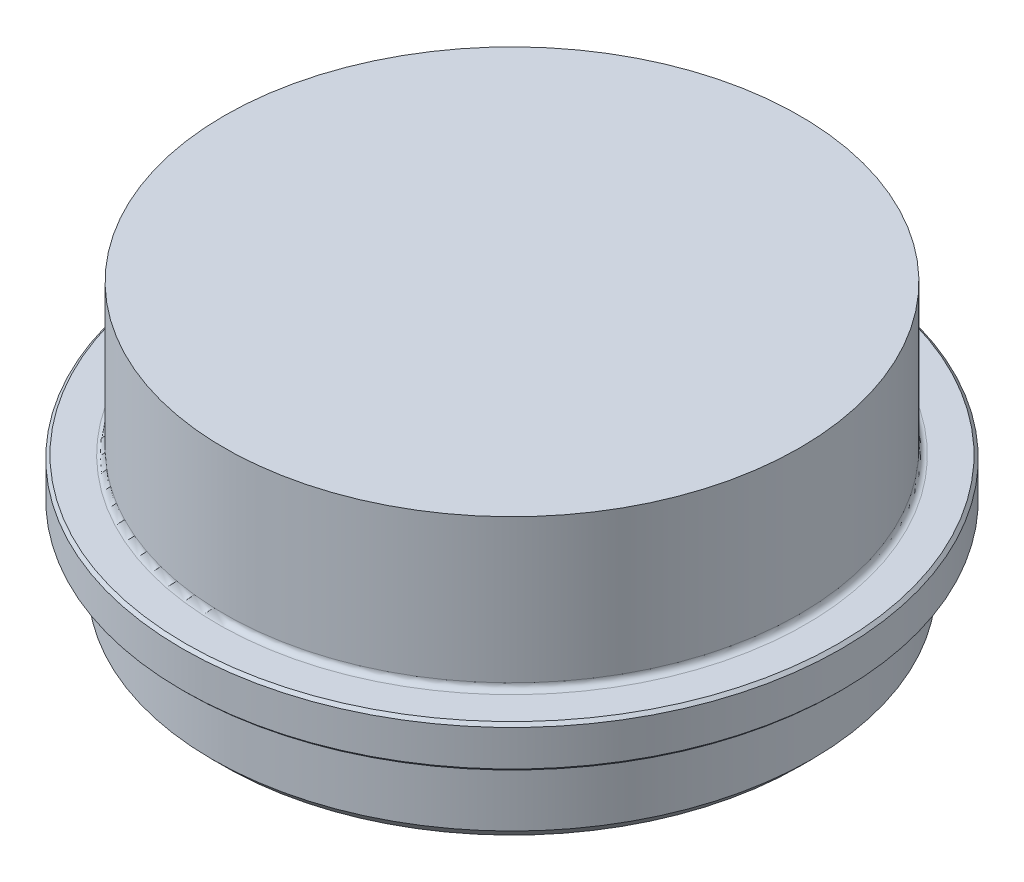
ISO-10303-21;
HEADER;
FILE_DESCRIPTION(('STEP AP214'),'2;1');
FILE_NAME('part.step','',(''),(''),'','','');
FILE_SCHEMA(('AUTOMOTIVE_DESIGN { 1 0 10303 214 1 1 1 1 }'));
ENDSEC;
DATA;
#1=APPLICATION_CONTEXT('core data for automotive mechanical design processes');
#2=APPLICATION_PROTOCOL_DEFINITION('international standard','automotive_design',2000,#1);
#3=PRODUCT_CONTEXT('',#1,'mechanical');
#4=PRODUCT('Part','Part','',(#3));
#5=PRODUCT_RELATED_PRODUCT_CATEGORY('part','',(#4));
#6=PRODUCT_DEFINITION_FORMATION('','',#4);
#7=PRODUCT_DEFINITION_CONTEXT('part definition',#1,'design');
#8=PRODUCT_DEFINITION('design','',#6,#7);
#9=PRODUCT_DEFINITION_SHAPE('','',#8);
#10=(LENGTH_UNIT() NAMED_UNIT(*) SI_UNIT(.MILLI.,.METRE.));
#11=(NAMED_UNIT(*) PLANE_ANGLE_UNIT() SI_UNIT($,.RADIAN.));
#12=(NAMED_UNIT(*) SI_UNIT($,.STERADIAN.) SOLID_ANGLE_UNIT());
#13=UNCERTAINTY_MEASURE_WITH_UNIT(LENGTH_MEASURE(1.E-05),#10,'distance_accuracy_value','');
#14=(GEOMETRIC_REPRESENTATION_CONTEXT(3) GLOBAL_UNCERTAINTY_ASSIGNED_CONTEXT((#13)) GLOBAL_UNIT_ASSIGNED_CONTEXT((#10,
#11,#12)) REPRESENTATION_CONTEXT('',''));
#15=CARTESIAN_POINT('',(0.,0.,0.));
#16=DIRECTION('',(0.,0.,1.));
#17=DIRECTION('',(1.,0.,0.));
#18=AXIS2_PLACEMENT_3D('',#15,#16,#17);
#19=CARTESIAN_POINT('',(27.5,-16.,0.));
#20=DIRECTION('',(0.,-1.,0.));
#21=DIRECTION('',(1.,0.,0.));
#22=AXIS2_PLACEMENT_3D('',#19,#20,#21);
#23=PLANE('',#22);
#24=CARTESIAN_POINT('',(0.,-16.0000000000001,0.));
#25=DIRECTION('',(0.,-1.,0.));
#26=DIRECTION('',(1.,0.,0.));
#27=AXIS2_PLACEMENT_3D('',#24,#25,#26);
#28=CIRCLE('',#27,27.2500000000001);
#29=CARTESIAN_POINT('',(27.2500000000001,-16.,0.));
#30=VERTEX_POINT('',#29);
#31=EDGE_CURVE('E67',#30,#30,#28,.T.);
#32=ORIENTED_EDGE('',*,*,#31,.T.);
#33=EDGE_LOOP('',(#32));
#34=FACE_BOUND('',#33,.T.);
#35=CARTESIAN_POINT('',(0.,-16.0000000000001,0.));
#36=DIRECTION('',(0.,-1.,0.));
#37=DIRECTION('',(1.,0.,0.));
#38=AXIS2_PLACEMENT_3D('',#35,#36,#37);
#39=CIRCLE('',#38,24.9999999999999);
#40=CARTESIAN_POINT('',(25.,-16.,0.));
#41=VERTEX_POINT('',#40);
#42=EDGE_CURVE('E94',#41,#41,#39,.T.);
#43=ORIENTED_EDGE('',*,*,#42,.F.);
#44=EDGE_LOOP('',(#43));
#45=FACE_BOUND('',#44,.T.);
#46=ADVANCED_FACE('F38',(#34,#45),#23,.T.);
#47=CARTESIAN_POINT('',(1.35268772757415E-12,-394.34097291874,0.));
#48=DIRECTION('',(0.,-1.,0.));
#49=DIRECTION('',(1.,0.,0.));
#50=AXIS2_PLACEMENT_3D('',#47,#48,#49);
#51=CYLINDRICAL_SURFACE('',#50,27.5);
#52=CARTESIAN_POINT('',(0.,-15.7500000000002,0.));
#53=DIRECTION('',(0.,-1.,0.));
#54=DIRECTION('',(1.,0.,0.));
#55=AXIS2_PLACEMENT_3D('',#52,#53,#54);
#56=CIRCLE('',#55,27.5);
#57=CARTESIAN_POINT('',(27.5,-15.7500000000001,0.));
#58=VERTEX_POINT('',#57);
#59=EDGE_CURVE('E61',#58,#58,#56,.F.);
#60=ORIENTED_EDGE('',*,*,#59,.T.);
#61=EDGE_LOOP('',(#60));
#62=FACE_BOUND('',#61,.T.);
#63=CARTESIAN_POINT('',(0.,-12.7500000000001,0.));
#64=DIRECTION('',(0.,1.,0.));
#65=DIRECTION('',(-1.,0.,0.));
#66=AXIS2_PLACEMENT_3D('',#63,#64,#65);
#67=CIRCLE('',#66,27.5);
#68=CARTESIAN_POINT('',(-27.4999999999999,-12.7500000000002,0.));
#69=VERTEX_POINT('',#68);
#70=EDGE_CURVE('E64',#69,#69,#67,.F.);
#71=ORIENTED_EDGE('',*,*,#70,.T.);
#72=EDGE_LOOP('',(#71));
#73=FACE_BOUND('',#72,.T.);
#74=ADVANCED_FACE('F170',(#62,#73),#51,.T.);
#75=CARTESIAN_POINT('',(27.5,-12.5,0.));
#76=DIRECTION('',(0.,1.,0.));
#77=DIRECTION('',(-1.,0.,0.));
#78=AXIS2_PLACEMENT_3D('',#75,#76,#77);
#79=PLANE('',#78);
#80=CARTESIAN_POINT('',(0.,-12.5000000000001,0.));
#81=DIRECTION('',(0.,1.,0.));
#82=DIRECTION('',(-1.,0.,0.));
#83=AXIS2_PLACEMENT_3D('',#80,#81,#82);
#84=CIRCLE('',#83,24.5);
#85=CARTESIAN_POINT('',(-24.4999999999999,-12.5000000000002,0.));
#86=VERTEX_POINT('',#85);
#87=EDGE_CURVE('E53',#86,#86,#84,.F.);
#88=ORIENTED_EDGE('',*,*,#87,.T.);
#89=EDGE_LOOP('',(#88));
#90=FACE_BOUND('',#89,.T.);
#91=CARTESIAN_POINT('',(0.,-12.5000000000001,0.));
#92=DIRECTION('',(0.,1.,0.));
#93=DIRECTION('',(-1.,0.,0.));
#94=AXIS2_PLACEMENT_3D('',#91,#92,#93);
#95=CIRCLE('',#94,27.2499999999999);
#96=CARTESIAN_POINT('',(-27.2499999999998,-12.5000000000002,0.));
#97=VERTEX_POINT('',#96);
#98=EDGE_CURVE('E58',#97,#97,#95,.T.);
#99=ORIENTED_EDGE('',*,*,#98,.T.);
#100=EDGE_LOOP('',(#99));
#101=FACE_BOUND('',#100,.T.);
#102=ADVANCED_FACE('F176',(#90,#101),#79,.T.);
#103=CARTESIAN_POINT('',(1.35268772757415E-12,-394.34097291874,0.));
#104=DIRECTION('',(0.,-1.,0.));
#105=DIRECTION('',(1.,0.,0.));
#106=AXIS2_PLACEMENT_3D('',#103,#104,#105);
#107=CYLINDRICAL_SURFACE('',#106,24.);
#108=CARTESIAN_POINT('',(0.,-12.0000000000001,0.));
#109=DIRECTION('',(0.,1.,0.));
#110=DIRECTION('',(-1.,0.,0.));
#111=AXIS2_PLACEMENT_3D('',#108,#109,#110);
#112=CIRCLE('',#111,24.);
#113=CARTESIAN_POINT('',(-23.9999999999999,-12.0000000000002,0.));
#114=VERTEX_POINT('',#113);
#115=EDGE_CURVE('E49',#114,#114,#112,.T.);
#116=ORIENTED_EDGE('',*,*,#115,.T.);
#117=EDGE_LOOP('',(#116));
#118=FACE_BOUND('',#117,.T.);
#119=CARTESIAN_POINT('',(0.,0.,0.));
#120=DIRECTION('',(0.,-1.,0.));
#121=DIRECTION('',(1.,0.,0.));
#122=AXIS2_PLACEMENT_3D('',#119,#120,#121);
#123=CIRCLE('',#122,24.);
#124=CARTESIAN_POINT('',(24.,0.,0.));
#125=VERTEX_POINT('',#124);
#126=EDGE_CURVE('E88',#125,#125,#123,.T.);
#127=ORIENTED_EDGE('',*,*,#126,.T.);
#128=EDGE_LOOP('',(#127));
#129=FACE_BOUND('',#128,.T.);
#130=ADVANCED_FACE('F214',(#118,#129),#107,.T.);
#131=CARTESIAN_POINT('',(0.,0.,0.));
#132=DIRECTION('',(0.,1.,0.));
#133=DIRECTION('',(-1.,0.,0.));
#134=AXIS2_PLACEMENT_3D('',#131,#132,#133);
#135=PLANE('',#134);
#136=ORIENTED_EDGE('',*,*,#126,.F.);
#137=EDGE_LOOP('',(#136));
#138=FACE_BOUND('',#137,.T.);
#139=ADVANCED_FACE('F222',(#138),#135,.T.);
#140=CARTESIAN_POINT('',(11.5,-4.99999999999998,0.));
#141=DIRECTION('',(0.,-1.,0.));
#142=DIRECTION('',(1.,0.,0.));
#143=AXIS2_PLACEMENT_3D('',#140,#141,#142);
#144=PLANE('',#143);
#145=CARTESIAN_POINT('',(0.,-5.00000000000002,0.));
#146=DIRECTION('',(0.,-1.,0.));
#147=DIRECTION('',(1.,0.,0.));
#148=AXIS2_PLACEMENT_3D('',#145,#146,#147);
#149=CIRCLE('',#148,11.);
#150=CARTESIAN_POINT('',(11.,-4.99999999999998,0.));
#151=VERTEX_POINT('',#150);
#152=EDGE_CURVE('E45',#151,#151,#149,.T.);
#153=ORIENTED_EDGE('',*,*,#152,.T.);
#154=EDGE_LOOP('',(#153));
#155=FACE_BOUND('',#154,.T.);
#156=ADVANCED_FACE('F228',(#155),#144,.T.);
#157=CARTESIAN_POINT('',(1.35268772757415E-12,-394.34097291874,0.));
#158=DIRECTION('',(0.,-1.,0.));
#159=DIRECTION('',(1.,0.,0.));
#160=AXIS2_PLACEMENT_3D('',#157,#158,#159);
#161=CYLINDRICAL_SURFACE('',#160,11.5);
#162=CARTESIAN_POINT('',(0.,-5.50000000000006,0.));
#163=DIRECTION('',(0.,-1.,0.));
#164=DIRECTION('',(1.,0.,0.));
#165=AXIS2_PLACEMENT_3D('',#162,#163,#164);
#166=CIRCLE('',#165,11.5);
#167=CARTESIAN_POINT('',(11.5,-5.50000000000002,0.));
#168=VERTEX_POINT('',#167);
#169=EDGE_CURVE('E10',#168,#168,#166,.F.);
#170=ORIENTED_EDGE('',*,*,#169,.T.);
#171=EDGE_LOOP('',(#170));
#172=FACE_BOUND('',#171,.T.);
#173=CARTESIAN_POINT('',(0.,-15.7500000000001,0.));
#174=DIRECTION('',(0.,-1.,0.));
#175=DIRECTION('',(1.,0.,0.));
#176=AXIS2_PLACEMENT_3D('',#173,#174,#175);
#177=CIRCLE('',#176,11.5);
#178=CARTESIAN_POINT('',(11.5,-15.7500000000001,0.));
#179=VERTEX_POINT('',#178);
#180=EDGE_CURVE('E73',#179,#179,#177,.T.);
#181=ORIENTED_EDGE('',*,*,#180,.T.);
#182=EDGE_LOOP('',(#181));
#183=FACE_BOUND('',#182,.T.);
#184=ADVANCED_FACE('F232',(#172,#183),#161,.F.);
#185=CARTESIAN_POINT('',(12.4,-16.,0.));
#186=DIRECTION('',(0.,-1.,0.));
#187=DIRECTION('',(1.,0.,0.));
#188=AXIS2_PLACEMENT_3D('',#185,#186,#187);
#189=PLANE('',#188);
#190=CARTESIAN_POINT('',(0.,-16.,0.));
#191=DIRECTION('',(0.,-1.,0.));
#192=DIRECTION('',(1.,0.,0.));
#193=AXIS2_PLACEMENT_3D('',#190,#191,#192);
#194=CIRCLE('',#193,11.7499999999999);
#195=CARTESIAN_POINT('',(11.7499999999999,-16.,0.));
#196=VERTEX_POINT('',#195);
#197=EDGE_CURVE('E70',#196,#196,#194,.F.);
#198=ORIENTED_EDGE('',*,*,#197,.T.);
#199=EDGE_LOOP('',(#198));
#200=FACE_BOUND('',#199,.T.);
#201=CARTESIAN_POINT('',(0.,-16.0000000000001,0.));
#202=DIRECTION('',(0.,-1.,0.));
#203=DIRECTION('',(1.,0.,0.));
#204=AXIS2_PLACEMENT_3D('',#201,#202,#203);
#205=CIRCLE('',#204,12.3999999999999);
#206=CARTESIAN_POINT('',(12.4,-16.,0.));
#207=VERTEX_POINT('',#206);
#208=EDGE_CURVE('E91',#207,#207,#205,.T.);
#209=ORIENTED_EDGE('',*,*,#208,.T.);
#210=EDGE_LOOP('',(#209));
#211=FACE_BOUND('',#210,.T.);
#212=ADVANCED_FACE('F235',(#200,#211),#189,.T.);
#213=CARTESIAN_POINT('',(1.35268772757415E-12,-394.34097291874,0.));
#214=DIRECTION('',(0.,-1.,0.));
#215=DIRECTION('',(1.,0.,0.));
#216=AXIS2_PLACEMENT_3D('',#213,#214,#215);
#217=CYLINDRICAL_SURFACE('',#216,12.3999999999999);
#218=CARTESIAN_POINT('',(0.,-22.0000000000001,0.));
#219=DIRECTION('',(0.,-1.,0.));
#220=DIRECTION('',(1.,0.,0.));
#221=AXIS2_PLACEMENT_3D('',#218,#219,#220);
#222=CIRCLE('',#221,12.3999999999999);
#223=CARTESIAN_POINT('',(12.4,-22.0000000000001,0.));
#224=VERTEX_POINT('',#223);
#225=EDGE_CURVE('E85',#224,#224,#222,.T.);
#226=ORIENTED_EDGE('',*,*,#225,.T.);
#227=EDGE_LOOP('',(#226));
#228=FACE_BOUND('',#227,.T.);
#229=ORIENTED_EDGE('',*,*,#208,.F.);
#230=EDGE_LOOP('',(#229));
#231=FACE_BOUND('',#230,.T.);
#232=ADVANCED_FACE('F141',(#228,#231),#217,.F.);
#233=CARTESIAN_POINT('',(25.,-23.,0.));
#234=DIRECTION('',(0.,-1.,0.));
#235=DIRECTION('',(1.,0.,0.));
#236=AXIS2_PLACEMENT_3D('',#233,#234,#235);
#237=PLANE('',#236);
#238=CARTESIAN_POINT('',(-14.1421356237309,-23.0000000000001,14.142135623731));
#239=DIRECTION('',(0.,-1.,0.));
#240=DIRECTION('',(-1.,0.,0.));
#241=AXIS2_PLACEMENT_3D('',#238,#239,#240);
#242=CIRCLE('',#241,2.5);
#243=CARTESIAN_POINT('',(-16.6421356237309,-23.0000000000001,14.142135623731));
#244=VERTEX_POINT('',#243);
#245=EDGE_CURVE('E111',#244,#244,#242,.T.);
#246=ORIENTED_EDGE('',*,*,#245,.F.);
#247=EDGE_LOOP('',(#246));
#248=FACE_BOUND('',#247,.T.);
#249=CARTESIAN_POINT('',(14.142135623731,-23.,-14.1421356237309));
#250=DIRECTION('',(0.,-1.,0.));
#251=DIRECTION('',(-1.,0.,0.));
#252=AXIS2_PLACEMENT_3D('',#249,#250,#251);
#253=CIRCLE('',#252,2.5);
#254=CARTESIAN_POINT('',(11.642135623731,-23.,-14.1421356237309));
#255=VERTEX_POINT('',#254);
#256=EDGE_CURVE('E104',#255,#255,#253,.T.);
#257=ORIENTED_EDGE('',*,*,#256,.F.);
#258=EDGE_LOOP('',(#257));
#259=FACE_BOUND('',#258,.T.);
#260=CARTESIAN_POINT('',(-14.1421356237309,-23.0000000000001,-14.1421356237309));
#261=DIRECTION('',(0.,-1.,0.));
#262=DIRECTION('',(1.,0.,0.));
#263=AXIS2_PLACEMENT_3D('',#260,#261,#262);
#264=CIRCLE('',#263,2.5);
#265=CARTESIAN_POINT('',(-11.6421356237309,-23.0000000000001,-14.1421356237309));
#266=VERTEX_POINT('',#265);
#267=EDGE_CURVE('E122',#266,#266,#264,.T.);
#268=ORIENTED_EDGE('',*,*,#267,.F.);
#269=EDGE_LOOP('',(#268));
#270=FACE_BOUND('',#269,.T.);
#271=CARTESIAN_POINT('',(0.,-23.0000000000001,19.9999999999999));
#272=DIRECTION('',(0.,-1.,0.));
#273=DIRECTION('',(1.,0.,0.));
#274=AXIS2_PLACEMENT_3D('',#271,#272,#273);
#275=CIRCLE('',#274,3.);
#276=CARTESIAN_POINT('',(3.00000000000008,-23.0000000000001,19.9999999999999));
#277=VERTEX_POINT('',#276);
#278=EDGE_CURVE('E116',#277,#277,#275,.T.);
#279=ORIENTED_EDGE('',*,*,#278,.F.);
#280=EDGE_LOOP('',(#279));
#281=FACE_BOUND('',#280,.T.);
#282=CARTESIAN_POINT('',(14.142135623731,-23.,14.142135623731));
#283=DIRECTION('',(0.,-1.,0.));
#284=DIRECTION('',(1.,0.,0.));
#285=AXIS2_PLACEMENT_3D('',#282,#283,#284);
#286=CIRCLE('',#285,2.5);
#287=CARTESIAN_POINT('',(16.642135623731,-23.,14.142135623731));
#288=VERTEX_POINT('',#287);
#289=EDGE_CURVE('E98',#288,#288,#286,.T.);
#290=ORIENTED_EDGE('',*,*,#289,.F.);
#291=EDGE_LOOP('',(#290));
#292=FACE_BOUND('',#291,.T.);
#293=CARTESIAN_POINT('',(0.,-23.0000000000001,0.));
#294=DIRECTION('',(0.,-1.,0.));
#295=DIRECTION('',(1.,0.,0.));
#296=AXIS2_PLACEMENT_3D('',#293,#294,#295);
#297=CIRCLE('',#296,13.3999999999999);
#298=CARTESIAN_POINT('',(13.4,-23.,0.));
#299=VERTEX_POINT('',#298);
#300=EDGE_CURVE('E79',#299,#299,#297,.F.);
#301=ORIENTED_EDGE('',*,*,#300,.T.);
#302=EDGE_LOOP('',(#301));
#303=FACE_BOUND('',#302,.T.);
#304=CARTESIAN_POINT('',(0.,-23.0000000000001,0.));
#305=DIRECTION('',(0.,-1.,0.));
#306=DIRECTION('',(1.,0.,0.));
#307=AXIS2_PLACEMENT_3D('',#304,#305,#306);
#308=CIRCLE('',#307,23.9999999999999);
#309=CARTESIAN_POINT('',(24.,-23.,0.));
#310=VERTEX_POINT('',#309);
#311=EDGE_CURVE('E82',#310,#310,#308,.T.);
#312=ORIENTED_EDGE('',*,*,#311,.T.);
#313=EDGE_LOOP('',(#312));
#314=FACE_BOUND('',#313,.T.);
#315=ADVANCED_FACE('F137',(#248,#259,#270,#281,#292,#303,#314),#237,.T.);
#316=CARTESIAN_POINT('',(1.35268772757415E-12,-394.34097291874,0.));
#317=DIRECTION('',(0.,-1.,0.));
#318=DIRECTION('',(1.,0.,0.));
#319=AXIS2_PLACEMENT_3D('',#316,#317,#318);
#320=CYLINDRICAL_SURFACE('',#319,24.9999999999999);
#321=CARTESIAN_POINT('',(0.,-22.0000000000001,0.));
#322=DIRECTION('',(0.,-1.,0.));
#323=DIRECTION('',(1.,0.,0.));
#324=AXIS2_PLACEMENT_3D('',#321,#322,#323);
#325=CIRCLE('',#324,24.9999999999999);
#326=CARTESIAN_POINT('',(25.,-22.,0.));
#327=VERTEX_POINT('',#326);
#328=EDGE_CURVE('E76',#327,#327,#325,.F.);
#329=ORIENTED_EDGE('',*,*,#328,.T.);
#330=EDGE_LOOP('',(#329));
#331=FACE_BOUND('',#330,.T.);
#332=ORIENTED_EDGE('',*,*,#42,.T.);
#333=EDGE_LOOP('',(#332));
#334=FACE_BOUND('',#333,.T.);
#335=ADVANCED_FACE('F140',(#331,#334),#320,.T.);
#336=CARTESIAN_POINT('',(0.,-22.0000000000001,0.));
#337=DIRECTION('',(0.,-1.,0.));
#338=DIRECTION('',(1.,0.,0.));
#339=AXIS2_PLACEMENT_3D('',#336,#337,#338);
#340=CONICAL_SURFACE('',#339,12.3999999999999,0.785398163397452);
#341=ORIENTED_EDGE('',*,*,#300,.F.);
#342=EDGE_LOOP('',(#341));
#343=FACE_BOUND('',#342,.T.);
#344=ORIENTED_EDGE('',*,*,#225,.F.);
#345=EDGE_LOOP('',(#344));
#346=FACE_BOUND('',#345,.T.);
#347=ADVANCED_FACE('F155',(#343,#346),#340,.F.);
#348=CARTESIAN_POINT('',(0.,-23.0000000000001,0.));
#349=DIRECTION('',(0.,1.,0.));
#350=DIRECTION('',(-1.,0.,0.));
#351=AXIS2_PLACEMENT_3D('',#348,#349,#350);
#352=CONICAL_SURFACE('',#351,23.9999999999999,0.785398163397454);
#353=ORIENTED_EDGE('',*,*,#328,.F.);
#354=EDGE_LOOP('',(#353));
#355=FACE_BOUND('',#354,.T.);
#356=ORIENTED_EDGE('',*,*,#311,.F.);
#357=EDGE_LOOP('',(#356));
#358=FACE_BOUND('',#357,.T.);
#359=ADVANCED_FACE('F152',(#355,#358),#352,.T.);
#360=CARTESIAN_POINT('',(0.,-15.7500000000001,0.));
#361=DIRECTION('',(0.,-1.,0.));
#362=DIRECTION('',(1.,0.,0.));
#363=AXIS2_PLACEMENT_3D('',#360,#361,#362);
#364=CONICAL_SURFACE('',#363,11.5,0.785398163397414);
#365=ORIENTED_EDGE('',*,*,#197,.F.);
#366=EDGE_LOOP('',(#365));
#367=FACE_BOUND('',#366,.T.);
#368=ORIENTED_EDGE('',*,*,#180,.F.);
#369=EDGE_LOOP('',(#368));
#370=FACE_BOUND('',#369,.T.);
#371=ADVANCED_FACE('F154',(#367,#370),#364,.F.);
#372=CARTESIAN_POINT('',(0.,-16.0000000000001,0.));
#373=DIRECTION('',(0.,1.,0.));
#374=DIRECTION('',(-1.,0.,0.));
#375=AXIS2_PLACEMENT_3D('',#372,#373,#374);
#376=CONICAL_SURFACE('',#375,27.25,0.785398163397358);
#377=ORIENTED_EDGE('',*,*,#59,.F.);
#378=EDGE_LOOP('',(#377));
#379=FACE_BOUND('',#378,.T.);
#380=ORIENTED_EDGE('',*,*,#31,.F.);
#381=EDGE_LOOP('',(#380));
#382=FACE_BOUND('',#381,.T.);
#383=ADVANCED_FACE('F162',(#379,#382),#376,.T.);
#384=CARTESIAN_POINT('',(0.,-12.7500000000001,0.));
#385=DIRECTION('',(0.,-1.,0.));
#386=DIRECTION('',(1.,0.,0.));
#387=AXIS2_PLACEMENT_3D('',#384,#385,#386);
#388=CONICAL_SURFACE('',#387,27.5,0.785398163397462);
#389=ORIENTED_EDGE('',*,*,#98,.F.);
#390=EDGE_LOOP('',(#389));
#391=FACE_BOUND('',#390,.T.);
#392=ORIENTED_EDGE('',*,*,#70,.F.);
#393=EDGE_LOOP('',(#392));
#394=FACE_BOUND('',#393,.T.);
#395=ADVANCED_FACE('F197',(#391,#394),#388,.T.);
#396=CARTESIAN_POINT('',(0.,-12.0000000000001,0.));
#397=DIRECTION('',(0.,1.,0.));
#398=DIRECTION('',(-1.,0.,0.));
#399=AXIS2_PLACEMENT_3D('',#396,#397,#398);
#400=TOROIDAL_SURFACE('',#399,24.5,0.5);
#401=ORIENTED_EDGE('',*,*,#115,.F.);
#402=EDGE_LOOP('',(#401));
#403=FACE_BOUND('',#402,.T.);
#404=ORIENTED_EDGE('',*,*,#87,.F.);
#405=EDGE_LOOP('',(#404));
#406=FACE_BOUND('',#405,.T.);
#407=ADVANCED_FACE('F199',(#403,#406),#400,.F.);
#408=CARTESIAN_POINT('',(0.,-5.50000000000006,0.));
#409=DIRECTION('',(0.,-1.,0.));
#410=DIRECTION('',(1.,0.,0.));
#411=AXIS2_PLACEMENT_3D('',#408,#409,#410);
#412=TOROIDAL_SURFACE('',#411,11.,0.5);
#413=ORIENTED_EDGE('',*,*,#169,.F.);
#414=EDGE_LOOP('',(#413));
#415=FACE_BOUND('',#414,.T.);
#416=ORIENTED_EDGE('',*,*,#152,.F.);
#417=EDGE_LOOP('',(#416));
#418=FACE_BOUND('',#417,.T.);
#419=ADVANCED_FACE('F40',(#415,#418),#412,.F.);
#420=CARTESIAN_POINT('',(14.142135623731,-9.00000000000002,14.142135623731));
#421=DIRECTION('',(0.,-1.,0.));
#422=DIRECTION('',(1.,0.,0.));
#423=AXIS2_PLACEMENT_3D('',#420,#421,#422);
#424=CYLINDRICAL_SURFACE('',#423,2.5);
#425=CARTESIAN_POINT('',(14.142135623731,-9.00000000000002,14.142135623731));
#426=DIRECTION('',(0.,-1.,0.));
#427=DIRECTION('',(1.,0.,0.));
#428=AXIS2_PLACEMENT_3D('',#425,#426,#427);
#429=CIRCLE('',#428,2.5);
#430=CARTESIAN_POINT('',(16.642135623731,-9.00000000000001,14.142135623731));
#431=VERTEX_POINT('',#430);
#432=EDGE_CURVE('E97',#431,#431,#429,.T.);
#433=ORIENTED_EDGE('',*,*,#432,.F.);
#434=EDGE_LOOP('',(#433));
#435=FACE_BOUND('',#434,.T.);
#436=ORIENTED_EDGE('',*,*,#289,.T.);
#437=EDGE_LOOP('',(#436));
#438=FACE_BOUND('',#437,.T.);
#439=ADVANCED_FACE('F206',(#435,#438),#424,.F.);
#440=CARTESIAN_POINT('',(14.142135623731,-9.00000000000002,14.142135623731));
#441=DIRECTION('',(0.,-1.,0.));
#442=DIRECTION('',(1.,0.,0.));
#443=AXIS2_PLACEMENT_3D('',#440,#441,#442);
#444=PLANE('',#443);
#445=ORIENTED_EDGE('',*,*,#432,.T.);
#446=EDGE_LOOP('',(#445));
#447=FACE_BOUND('',#446,.T.);
#448=ADVANCED_FACE('F247',(#447),#444,.T.);
#449=CARTESIAN_POINT('',(0.,-9.00000000000007,19.9999999999999));
#450=DIRECTION('',(0.,-1.,0.));
#451=DIRECTION('',(1.,0.,0.));
#452=AXIS2_PLACEMENT_3D('',#449,#450,#451);
#453=CYLINDRICAL_SURFACE('',#452,3.);
#454=CARTESIAN_POINT('',(0.,-9.00000000000007,19.9999999999999));
#455=DIRECTION('',(0.,-1.,0.));
#456=DIRECTION('',(1.,0.,0.));
#457=AXIS2_PLACEMENT_3D('',#454,#455,#456);
#458=CIRCLE('',#457,3.);
#459=CARTESIAN_POINT('',(3.00000000000003,-9.00000000000006,19.9999999999999));
#460=VERTEX_POINT('',#459);
#461=EDGE_CURVE('E119',#460,#460,#458,.T.);
#462=ORIENTED_EDGE('',*,*,#461,.F.);
#463=EDGE_LOOP('',(#462));
#464=FACE_BOUND('',#463,.T.);
#465=ORIENTED_EDGE('',*,*,#278,.T.);
#466=EDGE_LOOP('',(#465));
#467=FACE_BOUND('',#466,.T.);
#468=ADVANCED_FACE('F251',(#464,#467),#453,.F.);
#469=CARTESIAN_POINT('',(0.,-9.00000000000007,19.9999999999999));
#470=DIRECTION('',(0.,-1.,0.));
#471=DIRECTION('',(1.,0.,0.));
#472=AXIS2_PLACEMENT_3D('',#469,#470,#471);
#473=PLANE('',#472);
#474=ORIENTED_EDGE('',*,*,#461,.T.);
#475=EDGE_LOOP('',(#474));
#476=FACE_BOUND('',#475,.T.);
#477=ADVANCED_FACE('F133',(#476),#473,.T.);
#478=CARTESIAN_POINT('',(-14.1421356237309,-9.00000000000012,-14.1421356237309));
#479=DIRECTION('',(0.,-1.,0.));
#480=DIRECTION('',(1.,0.,0.));
#481=AXIS2_PLACEMENT_3D('',#478,#479,#480);
#482=CYLINDRICAL_SURFACE('',#481,2.5);
#483=CARTESIAN_POINT('',(-14.1421356237309,-9.00000000000012,-14.1421356237309));
#484=DIRECTION('',(0.,-1.,0.));
#485=DIRECTION('',(1.,0.,0.));
#486=AXIS2_PLACEMENT_3D('',#483,#484,#485);
#487=CIRCLE('',#486,2.5);
#488=CARTESIAN_POINT('',(-11.6421356237309,-9.00000000000011,-14.1421356237309));
#489=VERTEX_POINT('',#488);
#490=EDGE_CURVE('E108',#489,#489,#487,.T.);
#491=ORIENTED_EDGE('',*,*,#490,.F.);
#492=EDGE_LOOP('',(#491));
#493=FACE_BOUND('',#492,.T.);
#494=ORIENTED_EDGE('',*,*,#267,.T.);
#495=EDGE_LOOP('',(#494));
#496=FACE_BOUND('',#495,.T.);
#497=ADVANCED_FACE('F130',(#493,#496),#482,.F.);
#498=CARTESIAN_POINT('',(-14.1421356237309,-9.00000000000012,-14.1421356237309));
#499=DIRECTION('',(0.,-1.,0.));
#500=DIRECTION('',(1.,0.,0.));
#501=AXIS2_PLACEMENT_3D('',#498,#499,#500);
#502=PLANE('',#501);
#503=ORIENTED_EDGE('',*,*,#490,.T.);
#504=EDGE_LOOP('',(#503));
#505=FACE_BOUND('',#504,.T.);
#506=ADVANCED_FACE('F128',(#505),#502,.T.);
#507=CARTESIAN_POINT('',(14.142135623731,-9.00000000000002,-14.1421356237309));
#508=DIRECTION('',(0.,-1.,0.));
#509=DIRECTION('',(1.,0.,0.));
#510=AXIS2_PLACEMENT_3D('',#507,#508,#509);
#511=CYLINDRICAL_SURFACE('',#510,2.5);
#512=CARTESIAN_POINT('',(14.142135623731,-9.00000000000002,-14.1421356237309));
#513=DIRECTION('',(0.,-1.,0.));
#514=DIRECTION('',(-1.,0.,0.));
#515=AXIS2_PLACEMENT_3D('',#512,#513,#514);
#516=CIRCLE('',#515,2.5);
#517=CARTESIAN_POINT('',(11.642135623731,-9.00000000000003,-14.1421356237309));
#518=VERTEX_POINT('',#517);
#519=EDGE_CURVE('E107',#518,#518,#516,.T.);
#520=ORIENTED_EDGE('',*,*,#519,.F.);
#521=EDGE_LOOP('',(#520));
#522=FACE_BOUND('',#521,.T.);
#523=ORIENTED_EDGE('',*,*,#256,.T.);
#524=EDGE_LOOP('',(#523));
#525=FACE_BOUND('',#524,.T.);
#526=ADVANCED_FACE('F253',(#522,#525),#511,.F.);
#527=CARTESIAN_POINT('',(14.142135623731,-9.00000000000002,-14.1421356237309));
#528=DIRECTION('',(0.,1.,0.));
#529=DIRECTION('',(-1.,0.,0.));
#530=AXIS2_PLACEMENT_3D('',#527,#528,#529);
#531=PLANE('',#530);
#532=ORIENTED_EDGE('',*,*,#519,.T.);
#533=EDGE_LOOP('',(#532));
#534=FACE_BOUND('',#533,.T.);
#535=ADVANCED_FACE('F256',(#534),#531,.F.);
#536=CARTESIAN_POINT('',(-14.1421356237309,-9.00000000000012,14.142135623731));
#537=DIRECTION('',(0.,-1.,0.));
#538=DIRECTION('',(1.,0.,0.));
#539=AXIS2_PLACEMENT_3D('',#536,#537,#538);
#540=CYLINDRICAL_SURFACE('',#539,2.5);
#541=CARTESIAN_POINT('',(-14.1421356237309,-9.00000000000012,14.142135623731));
#542=DIRECTION('',(0.,-1.,0.));
#543=DIRECTION('',(-1.,0.,0.));
#544=AXIS2_PLACEMENT_3D('',#541,#542,#543);
#545=CIRCLE('',#544,2.5);
#546=CARTESIAN_POINT('',(-16.6421356237309,-9.00000000000013,14.142135623731));
#547=VERTEX_POINT('',#546);
#548=EDGE_CURVE('E101',#547,#547,#545,.T.);
#549=ORIENTED_EDGE('',*,*,#548,.F.);
#550=EDGE_LOOP('',(#549));
#551=FACE_BOUND('',#550,.T.);
#552=ORIENTED_EDGE('',*,*,#245,.T.);
#553=EDGE_LOOP('',(#552));
#554=FACE_BOUND('',#553,.T.);
#555=ADVANCED_FACE('F260',(#551,#554),#540,.F.);
#556=CARTESIAN_POINT('',(-14.1421356237309,-9.00000000000012,14.142135623731));
#557=DIRECTION('',(0.,1.,0.));
#558=DIRECTION('',(-1.,0.,0.));
#559=AXIS2_PLACEMENT_3D('',#556,#557,#558);
#560=PLANE('',#559);
#561=ORIENTED_EDGE('',*,*,#548,.T.);
#562=EDGE_LOOP('',(#561));
#563=FACE_BOUND('',#562,.T.);
#564=ADVANCED_FACE('F264',(#563),#560,.F.);
#565=CLOSED_SHELL('',(#46,#74,#102,#130,#139,#156,#184,#212,#232,#315,#335,#347,#359,#371,#383,
#395,#407,#419,#439,#448,#468,#477,#497,#506,#526,#535,#555,#564));
#566=MANIFOLD_SOLID_BREP('B2',#565);
#567=ADVANCED_BREP_SHAPE_REPRESENTATION('',(#18,#566),#14);
#568=SHAPE_DEFINITION_REPRESENTATION(#9,#567);
ENDSEC;
END-ISO-10303-21;
